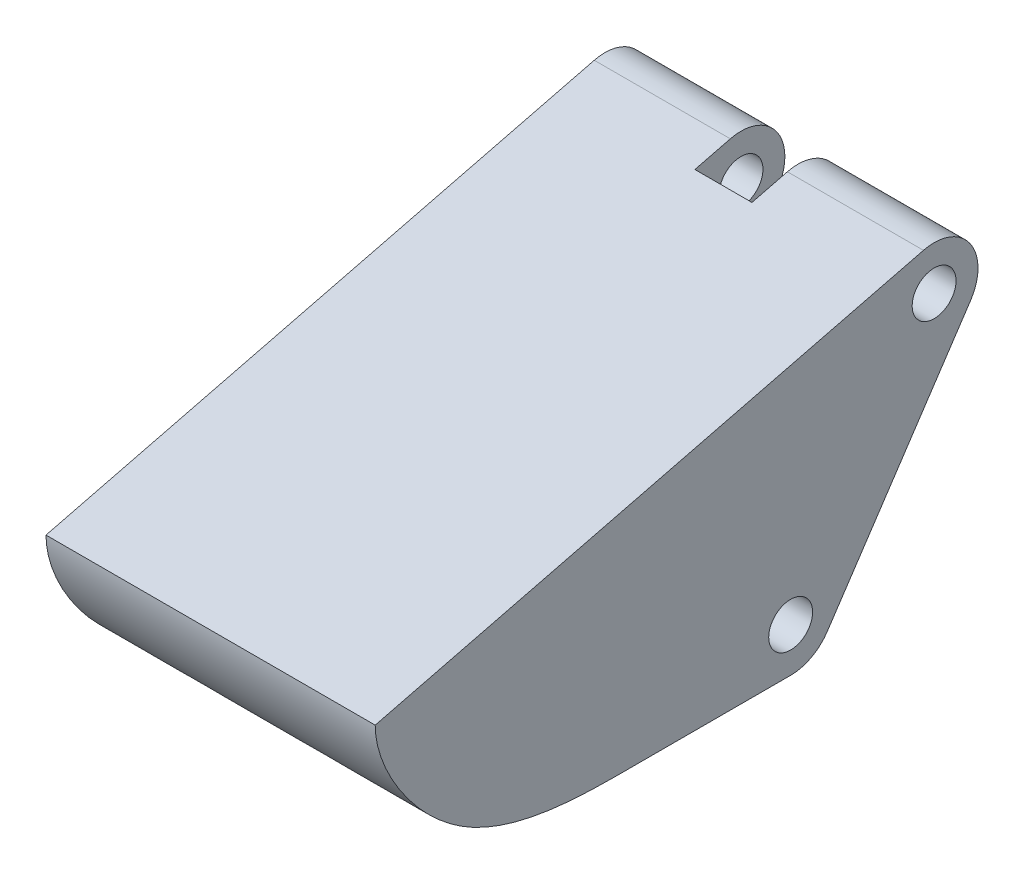
ISO-10303-21;
HEADER;
FILE_DESCRIPTION(('STEP AP214'),'2;1');
FILE_NAME('part.step','',(''),(''),'','','');
FILE_SCHEMA(('AUTOMOTIVE_DESIGN { 1 0 10303 214 1 1 1 1 }'));
ENDSEC;
DATA;
#1=APPLICATION_CONTEXT('core data for automotive mechanical design processes');
#2=APPLICATION_PROTOCOL_DEFINITION('international standard','automotive_design',2000,#1);
#3=PRODUCT_CONTEXT('',#1,'mechanical');
#4=PRODUCT('Part','Part','',(#3));
#5=PRODUCT_RELATED_PRODUCT_CATEGORY('part','',(#4));
#6=PRODUCT_DEFINITION_FORMATION('','',#4);
#7=PRODUCT_DEFINITION_CONTEXT('part definition',#1,'design');
#8=PRODUCT_DEFINITION('design','',#6,#7);
#9=PRODUCT_DEFINITION_SHAPE('','',#8);
#10=(LENGTH_UNIT() NAMED_UNIT(*) SI_UNIT(.MILLI.,.METRE.));
#11=(NAMED_UNIT(*) PLANE_ANGLE_UNIT() SI_UNIT($,.RADIAN.));
#12=(NAMED_UNIT(*) SI_UNIT($,.STERADIAN.) SOLID_ANGLE_UNIT());
#13=UNCERTAINTY_MEASURE_WITH_UNIT(LENGTH_MEASURE(1.E-05),#10,'distance_accuracy_value','');
#14=(GEOMETRIC_REPRESENTATION_CONTEXT(3) GLOBAL_UNCERTAINTY_ASSIGNED_CONTEXT((#13)) GLOBAL_UNIT_ASSIGNED_CONTEXT((#10,
#11,#12)) REPRESENTATION_CONTEXT('',''));
#15=CARTESIAN_POINT('',(0.,0.,0.));
#16=DIRECTION('',(0.,0.,1.));
#17=DIRECTION('',(1.,0.,0.));
#18=AXIS2_PLACEMENT_3D('',#15,#16,#17);
#19=CARTESIAN_POINT('',(-7.5,-5.5,11.070367516976));
#20=DIRECTION('',(1.,0.,0.));
#21=DIRECTION('',(0.,0.,1.));
#22=AXIS2_PLACEMENT_3D('',#19,#20,#21);
#23=CYLINDRICAL_SURFACE('',#22,2.);
#24=CARTESIAN_POINT('',(-5.,-5.5,11.070367516976));
#25=DIRECTION('',(1.,0.,0.));
#26=DIRECTION('',(0.,0.,-1.));
#27=AXIS2_PLACEMENT_3D('',#24,#25,#26);
#28=CIRCLE('',#27,2.);
#29=CARTESIAN_POINT('',(-5.,-6.60940039245046,9.4062669283003));
#30=VERTEX_POINT('',#29);
#31=CARTESIAN_POINT('',(-5.,-7.5,11.070367516976));
#32=VERTEX_POINT('',#31);
#33=EDGE_CURVE('E231',#30,#32,#28,.F.);
#34=ORIENTED_EDGE('',*,*,#33,.T.);
#35=DIRECTION('',(1.,0.,0.));
#36=VECTOR('',#35,1.);
#37=CARTESIAN_POINT('',(-7.5,-7.5,11.070367516976));
#38=LINE('',#37,#36);
#39=CARTESIAN_POINT('',(-7.5,-7.5,11.070367516976));
#40=VERTEX_POINT('',#39);
#41=EDGE_CURVE('E146',#40,#32,#38,.T.);
#42=ORIENTED_EDGE('',*,*,#41,.F.);
#43=CARTESIAN_POINT('',(-7.5,-5.5,11.070367516976));
#44=DIRECTION('',(1.,0.,0.));
#45=DIRECTION('',(0.,0.,-1.));
#46=AXIS2_PLACEMENT_3D('',#43,#44,#45);
#47=CIRCLE('',#46,2.);
#48=CARTESIAN_POINT('',(-7.5,-6.60940039245046,9.4062669283003));
#49=VERTEX_POINT('',#48);
#50=EDGE_CURVE('E125',#49,#40,#47,.F.);
#51=ORIENTED_EDGE('',*,*,#50,.F.);
#52=DIRECTION('',(1.,0.,0.));
#53=VECTOR('',#52,1.);
#54=CARTESIAN_POINT('',(-7.5,-6.60940039245046,9.4062669283003));
#55=LINE('',#54,#53);
#56=EDGE_CURVE('E133',#49,#30,#55,.T.);
#57=ORIENTED_EDGE('',*,*,#56,.T.);
#58=EDGE_LOOP('',(#34,#42,#51,#57));
#59=FACE_BOUND('',#58,.T.);
#60=ADVANCED_FACE('F49',(#59),#23,.T.);
#61=CARTESIAN_POINT('',(-7.5,-5.5,11.070367516976));
#62=DIRECTION('',(1.,0.,0.));
#63=DIRECTION('',(0.,0.,1.));
#64=AXIS2_PLACEMENT_3D('',#61,#62,#63);
#65=CYLINDRICAL_SURFACE('',#64,1.);
#66=CARTESIAN_POINT('',(-5.,-5.5,11.070367516976));
#67=DIRECTION('',(1.,0.,0.));
#68=DIRECTION('',(0.,0.,-1.));
#69=AXIS2_PLACEMENT_3D('',#66,#67,#68);
#70=CIRCLE('',#69,1.);
#71=CARTESIAN_POINT('',(-5.,-5.5,10.070367516976));
#72=VERTEX_POINT('',#71);
#73=EDGE_CURVE('E223',#72,#72,#70,.T.);
#74=ORIENTED_EDGE('',*,*,#73,.T.);
#75=EDGE_LOOP('',(#74));
#76=FACE_BOUND('',#75,.T.);
#77=CARTESIAN_POINT('',(-7.5,-5.5,11.070367516976));
#78=DIRECTION('',(1.,0.,0.));
#79=DIRECTION('',(0.,0.,-1.));
#80=AXIS2_PLACEMENT_3D('',#77,#78,#79);
#81=CIRCLE('',#80,1.);
#82=CARTESIAN_POINT('',(-7.5,-5.5,10.070367516976));
#83=VERTEX_POINT('',#82);
#84=EDGE_CURVE('E285',#83,#83,#81,.T.);
#85=ORIENTED_EDGE('',*,*,#84,.F.);
#86=EDGE_LOOP('',(#85));
#87=FACE_BOUND('',#86,.T.);
#88=ADVANCED_FACE('F313',(#76,#87),#65,.F.);
#89=CARTESIAN_POINT('',(-7.5,4.3050263695366,4.53368327061825));
#90=DIRECTION('',(1.,0.,0.));
#91=DIRECTION('',(0.,0.,1.));
#92=AXIS2_PLACEMENT_3D('',#89,#90,#91);
#93=CYLINDRICAL_SURFACE('',#92,1.);
#94=CARTESIAN_POINT('',(1.3,4.3050263695366,4.53368327061825));
#95=DIRECTION('',(-1.,0.,0.));
#96=DIRECTION('',(0.,0.,1.));
#97=AXIS2_PLACEMENT_3D('',#94,#95,#96);
#98=CIRCLE('',#97,1.);
#99=CARTESIAN_POINT('',(1.3,4.3050263695366,5.53368327061825));
#100=VERTEX_POINT('',#99);
#101=EDGE_CURVE('E275',#100,#100,#98,.T.);
#102=ORIENTED_EDGE('',*,*,#101,.T.);
#103=EDGE_LOOP('',(#102));
#104=FACE_BOUND('',#103,.T.);
#105=CARTESIAN_POINT('',(7.5,4.3050263695366,4.53368327061825));
#106=DIRECTION('',(1.,0.,0.));
#107=DIRECTION('',(0.,0.,-1.));
#108=AXIS2_PLACEMENT_3D('',#105,#106,#107);
#109=CIRCLE('',#108,1.);
#110=CARTESIAN_POINT('',(7.5,4.3050263695366,3.53368327061825));
#111=VERTEX_POINT('',#110);
#112=EDGE_CURVE('E157',#111,#111,#109,.T.);
#113=ORIENTED_EDGE('',*,*,#112,.T.);
#114=EDGE_LOOP('',(#113));
#115=FACE_BOUND('',#114,.T.);
#116=ADVANCED_FACE('F320',(#104,#115),#93,.F.);
#117=CARTESIAN_POINT('',(-7.5,4.3050263695366,4.53368327061825));
#118=DIRECTION('',(1.,0.,0.));
#119=DIRECTION('',(0.,0.,1.));
#120=AXIS2_PLACEMENT_3D('',#117,#118,#119);
#121=CYLINDRICAL_SURFACE('',#120,2.);
#122=CARTESIAN_POINT('',(1.3,4.3050263695366,4.53368327061825));
#123=DIRECTION('',(-1.,0.,0.));
#124=DIRECTION('',(0.,0.,1.));
#125=AXIS2_PLACEMENT_3D('',#122,#123,#124);
#126=CIRCLE('',#125,2.);
#127=CARTESIAN_POINT('',(1.3,6.24531136982727,5.01875452069092));
#128=VERTEX_POINT('',#127);
#129=CARTESIAN_POINT('',(1.3,3.19562597708615,2.86958268194257));
#130=VERTEX_POINT('',#129);
#131=EDGE_CURVE('E211',#128,#130,#126,.T.);
#132=ORIENTED_EDGE('',*,*,#131,.F.);
#133=DIRECTION('',(1.,0.,0.));
#134=VECTOR('',#133,1.);
#135=CARTESIAN_POINT('',(-7.5,6.24531136982727,5.01875452069092));
#136=LINE('',#135,#134);
#137=CARTESIAN_POINT('',(7.5,6.24531136982727,5.01875452069092));
#138=VERTEX_POINT('',#137);
#139=EDGE_CURVE('E156',#128,#138,#136,.T.);
#140=ORIENTED_EDGE('',*,*,#139,.T.);
#141=CARTESIAN_POINT('',(7.5,4.3050263695366,4.53368327061825));
#142=DIRECTION('',(1.,0.,0.));
#143=DIRECTION('',(0.,0.,-1.));
#144=AXIS2_PLACEMENT_3D('',#141,#142,#143);
#145=CIRCLE('',#144,2.);
#146=CARTESIAN_POINT('',(7.5,3.19562597708615,2.86958268194257));
#147=VERTEX_POINT('',#146);
#148=EDGE_CURVE('E187',#147,#138,#145,.T.);
#149=ORIENTED_EDGE('',*,*,#148,.F.);
#150=DIRECTION('',(1.,0.,0.));
#151=VECTOR('',#150,1.);
#152=CARTESIAN_POINT('',(-7.5,3.19562597708615,2.86958268194257));
#153=LINE('',#152,#151);
#154=EDGE_CURVE('E194',#130,#147,#153,.T.);
#155=ORIENTED_EDGE('',*,*,#154,.F.);
#156=EDGE_LOOP('',(#132,#140,#149,#155));
#157=FACE_BOUND('',#156,.T.);
#158=ADVANCED_FACE('F309',(#157),#121,.T.);
#159=CARTESIAN_POINT('',(-7.5,7.05882352941176,1.76470588235294));
#160=DIRECTION('',(0.,-0.970142500145332,-0.242535625036333));
#161=DIRECTION('',(0.,0.242535625036333,-0.970142500145332));
#162=AXIS2_PLACEMENT_3D('',#159,#160,#161);
#163=PLANE('',#162);
#164=DIRECTION('',(1.,0.,0.));
#165=VECTOR('',#164,1.);
#166=CARTESIAN_POINT('',(-7.5,5.84157918234543,6.63368327061825));
#167=LINE('',#166,#165);
#168=CARTESIAN_POINT('',(-1.3,5.84157918234543,6.63368327061825));
#169=VERTEX_POINT('',#168);
#170=CARTESIAN_POINT('',(1.3,5.84157918234543,6.63368327061825));
#171=VERTEX_POINT('',#170);
#172=EDGE_CURVE('E162',#169,#171,#167,.T.);
#173=ORIENTED_EDGE('',*,*,#172,.F.);
#174=DIRECTION('',(0.,-0.242535625036333,0.970142500145332));
#175=VECTOR('',#174,1.);
#176=CARTESIAN_POINT('',(-1.3,7.05882352941176,1.76470588235294));
#177=LINE('',#176,#175);
#178=CARTESIAN_POINT('',(-1.3,6.24531136982727,5.01875452069092));
#179=VERTEX_POINT('',#178);
#180=EDGE_CURVE('E259',#179,#169,#177,.T.);
#181=ORIENTED_EDGE('',*,*,#180,.F.);
#182=CARTESIAN_POINT('',(-7.5,6.24531136982727,5.01875452069092));
#183=VERTEX_POINT('',#182);
#184=EDGE_CURVE('E191',#183,#179,#136,.T.);
#185=ORIENTED_EDGE('',*,*,#184,.F.);
#186=DIRECTION('',(0.,-0.242535625036333,0.970142500145332));
#187=VECTOR('',#186,1.);
#188=CARTESIAN_POINT('',(-7.5,7.05882352941176,1.76470588235294));
#189=LINE('',#188,#187);
#190=CARTESIAN_POINT('',(-7.5,0.,30.));
#191=VERTEX_POINT('',#190);
#192=EDGE_CURVE('E289',#183,#191,#189,.T.);
#193=ORIENTED_EDGE('',*,*,#192,.T.);
#194=DIRECTION('',(1.,0.,0.));
#195=VECTOR('',#194,1.);
#196=CARTESIAN_POINT('',(-7.5,0.,30.));
#197=LINE('',#196,#195);
#198=CARTESIAN_POINT('',(7.5,0.,30.));
#199=VERTEX_POINT('',#198);
#200=EDGE_CURVE('E204',#191,#199,#197,.T.);
#201=ORIENTED_EDGE('',*,*,#200,.T.);
#202=DIRECTION('',(0.,-0.242535625036333,0.970142500145332));
#203=VECTOR('',#202,1.);
#204=CARTESIAN_POINT('',(7.5,7.05882352941176,1.76470588235294));
#205=LINE('',#204,#203);
#206=EDGE_CURVE('E102',#138,#199,#205,.T.);
#207=ORIENTED_EDGE('',*,*,#206,.F.);
#208=ORIENTED_EDGE('',*,*,#139,.F.);
#209=DIRECTION('',(0.,0.242535625036333,-0.970142500145332));
#210=VECTOR('',#209,1.);
#211=CARTESIAN_POINT('',(1.3,7.05882352941176,1.76470588235294));
#212=LINE('',#211,#210);
#213=EDGE_CURVE('E267',#171,#128,#212,.T.);
#214=ORIENTED_EDGE('',*,*,#213,.F.);
#215=EDGE_LOOP('',(#173,#181,#185,#193,#201,#207,#208,#214));
#216=FACE_BOUND('',#215,.T.);
#217=ADVANCED_FACE('F305',(#216),#163,.F.);
#218=CARTESIAN_POINT('',(-7.5,0.,30.));
#219=CARTESIAN_POINT('',(-7.5,-1.86201061413692,30.));
#220=CARTESIAN_POINT('',(-7.5,-7.67088107731904,26.2969055526664));
#221=CARTESIAN_POINT('',(-7.5,-7.5,20.233591890825));
#222=CARTESIAN_POINT('',(-7.5,-7.5,18.));
#223=B_SPLINE_CURVE_WITH_KNOTS('',3,(#218,#219,#220,#221,#222),.UNSPECIFIED.,.F.,.F.,(4,1,4),
(0.,0.469762972864334,1.),.UNSPECIFIED.);
#224=DIRECTION('',(1.,0.,0.));
#225=VECTOR('',#224,1.);
#226=SURFACE_OF_LINEAR_EXTRUSION('',#223,#225);
#227=CARTESIAN_POINT('',(7.5,0.,30.));
#228=CARTESIAN_POINT('',(7.5,-1.86201061413692,30.));
#229=CARTESIAN_POINT('',(7.5,-7.67088107731904,26.2969055526664));
#230=CARTESIAN_POINT('',(7.5,-7.5,20.233591890825));
#231=CARTESIAN_POINT('',(7.5,-7.5,18.));
#232=B_SPLINE_CURVE_WITH_KNOTS('',3,(#227,#228,#229,#230,#231),.UNSPECIFIED.,.F.,.F.,(4,1,4),
(0.,0.469762972864334,1.),.UNSPECIFIED.);
#233=CARTESIAN_POINT('',(7.5,-7.5,18.));
#234=VERTEX_POINT('',#233);
#235=EDGE_CURVE('E168',#199,#234,#232,.T.);
#236=ORIENTED_EDGE('',*,*,#235,.F.);
#237=ORIENTED_EDGE('',*,*,#200,.F.);
#238=CARTESIAN_POINT('',(-7.5,-7.5,18.));
#239=VERTEX_POINT('',#238);
#240=EDGE_CURVE('E110',#191,#239,#223,.T.);
#241=ORIENTED_EDGE('',*,*,#240,.T.);
#242=DIRECTION('',(1.,0.,0.));
#243=VECTOR('',#242,1.);
#244=CARTESIAN_POINT('',(-7.5,-7.5,18.));
#245=LINE('',#244,#243);
#246=EDGE_CURVE('E200',#239,#234,#245,.T.);
#247=ORIENTED_EDGE('',*,*,#246,.T.);
#248=EDGE_LOOP('',(#236,#237,#241,#247));
#249=FACE_BOUND('',#248,.T.);
#250=ADVANCED_FACE('F300',(#249),#226,.T.);
#251=CARTESIAN_POINT('',(-7.5,-7.5,0.));
#252=DIRECTION('',(0.,1.,0.));
#253=DIRECTION('',(0.,0.,1.));
#254=AXIS2_PLACEMENT_3D('',#251,#252,#253);
#255=PLANE('',#254);
#256=CARTESIAN_POINT('',(0.,-7.5,10.7537427266206));
#257=DIRECTION('',(0.,1.,0.));
#258=DIRECTION('',(0.,0.,1.));
#259=AXIS2_PLACEMENT_3D('',#256,#257,#258);
#260=CIRCLE('',#259,6.);
#261=CARTESIAN_POINT('',(-5.,-7.5,14.070367516976));
#262=VERTEX_POINT('',#261);
#263=CARTESIAN_POINT('',(5.,-7.5,14.070367516976));
#264=VERTEX_POINT('',#263);
#265=EDGE_CURVE('E340',#262,#264,#260,.T.);
#266=ORIENTED_EDGE('',*,*,#265,.T.);
#267=DIRECTION('',(0.,0.,-1.));
#268=VECTOR('',#267,1.);
#269=CARTESIAN_POINT('',(5.,-7.5,7.07036751697599));
#270=LINE('',#269,#268);
#271=CARTESIAN_POINT('',(5.,-7.5,11.070367516976));
#272=VERTEX_POINT('',#271);
#273=EDGE_CURVE('E344',#264,#272,#270,.T.);
#274=ORIENTED_EDGE('',*,*,#273,.T.);
#275=CARTESIAN_POINT('',(7.5,-7.5,11.070367516976));
#276=VERTEX_POINT('',#275);
#277=EDGE_CURVE('E142',#272,#276,#38,.T.);
#278=ORIENTED_EDGE('',*,*,#277,.T.);
#279=DIRECTION('',(0.,0.,-1.));
#280=VECTOR('',#279,1.);
#281=CARTESIAN_POINT('',(7.5,-7.5,0.));
#282=LINE('',#281,#280);
#283=EDGE_CURVE('E174',#234,#276,#282,.T.);
#284=ORIENTED_EDGE('',*,*,#283,.F.);
#285=ORIENTED_EDGE('',*,*,#246,.F.);
#286=DIRECTION('',(0.,0.,-1.));
#287=VECTOR('',#286,1.);
#288=CARTESIAN_POINT('',(-7.5,-7.5,0.));
#289=LINE('',#288,#287);
#290=EDGE_CURVE('E148',#239,#40,#289,.T.);
#291=ORIENTED_EDGE('',*,*,#290,.T.);
#292=ORIENTED_EDGE('',*,*,#41,.T.);
#293=DIRECTION('',(0.,0.,1.));
#294=VECTOR('',#293,1.);
#295=CARTESIAN_POINT('',(-5.,-7.5,7.07036751697599));
#296=LINE('',#295,#294);
#297=EDGE_CURVE('E347',#32,#262,#296,.T.);
#298=ORIENTED_EDGE('',*,*,#297,.T.);
#299=EDGE_LOOP('',(#266,#274,#278,#284,#285,#291,#292,#298));
#300=FACE_BOUND('',#299,.T.);
#301=ADVANCED_FACE('F304',(#300),#255,.F.);
#302=CARTESIAN_POINT('',(5.,-5.5,11.070367516976));
#303=DIRECTION('',(-1.,0.,0.));
#304=DIRECTION('',(0.,0.,1.));
#305=AXIS2_PLACEMENT_3D('',#302,#303,#304);
#306=CIRCLE('',#305,2.);
#307=CARTESIAN_POINT('',(5.,-6.60940039245046,9.4062669283003));
#308=VERTEX_POINT('',#307);
#309=EDGE_CURVE('E226',#272,#308,#306,.F.);
#310=ORIENTED_EDGE('',*,*,#309,.T.);
#311=CARTESIAN_POINT('',(7.5,-6.60940039245046,9.4062669283003));
#312=VERTEX_POINT('',#311);
#313=EDGE_CURVE('E143',#308,#312,#55,.T.);
#314=ORIENTED_EDGE('',*,*,#313,.T.);
#315=CARTESIAN_POINT('',(7.5,-5.5,11.070367516976));
#316=DIRECTION('',(1.,0.,0.));
#317=DIRECTION('',(0.,0.,-1.));
#318=AXIS2_PLACEMENT_3D('',#315,#316,#317);
#319=CIRCLE('',#318,2.);
#320=EDGE_CURVE('E181',#312,#276,#319,.F.);
#321=ORIENTED_EDGE('',*,*,#320,.T.);
#322=ORIENTED_EDGE('',*,*,#277,.F.);
#323=EDGE_LOOP('',(#310,#314,#321,#322));
#324=FACE_BOUND('',#323,.T.);
#325=ADVANCED_FACE('F321',(#324),#23,.T.);
#326=CARTESIAN_POINT('',(-7.5,2.30769230769231,3.46153846153846));
#327=DIRECTION('',(0.,-0.554700196225229,-0.832050294337844));
#328=DIRECTION('',(0.,0.832050294337844,-0.554700196225229));
#329=AXIS2_PLACEMENT_3D('',#326,#327,#328);
#330=PLANE('',#329);
#331=DIRECTION('',(0.,-0.832050294337844,0.554700196225229));
#332=VECTOR('',#331,1.);
#333=CARTESIAN_POINT('',(-5.,2.30769230769231,3.46153846153846));
#334=LINE('',#333,#332);
#335=CARTESIAN_POINT('',(-5.,-3.5,7.33333333333333));
#336=VERTEX_POINT('',#335);
#337=EDGE_CURVE('E137',#336,#30,#334,.T.);
#338=ORIENTED_EDGE('',*,*,#337,.T.);
#339=ORIENTED_EDGE('',*,*,#56,.F.);
#340=DIRECTION('',(0.,-0.832050294337844,0.554700196225229));
#341=VECTOR('',#340,1.);
#342=CARTESIAN_POINT('',(-7.5,2.30769230769231,3.46153846153846));
#343=LINE('',#342,#341);
#344=CARTESIAN_POINT('',(-7.5,3.19562597708615,2.86958268194257));
#345=VERTEX_POINT('',#344);
#346=EDGE_CURVE('E121',#345,#49,#343,.T.);
#347=ORIENTED_EDGE('',*,*,#346,.F.);
#348=CARTESIAN_POINT('',(-1.3,3.19562597708615,2.86958268194257));
#349=VERTEX_POINT('',#348);
#350=EDGE_CURVE('E195',#345,#349,#153,.T.);
#351=ORIENTED_EDGE('',*,*,#350,.T.);
#352=DIRECTION('',(0.,-0.832050294337844,0.554700196225229));
#353=VECTOR('',#352,1.);
#354=CARTESIAN_POINT('',(-1.3,2.30769230769231,3.46153846153846));
#355=LINE('',#354,#353);
#356=CARTESIAN_POINT('',(-1.3,-2.45052490592739,6.63368327061825));
#357=VERTEX_POINT('',#356);
#358=EDGE_CURVE('E252',#349,#357,#355,.T.);
#359=ORIENTED_EDGE('',*,*,#358,.T.);
#360=DIRECTION('',(1.,0.,0.));
#361=VECTOR('',#360,1.);
#362=CARTESIAN_POINT('',(-7.5,-2.45052490592739,6.63368327061825));
#363=LINE('',#362,#361);
#364=CARTESIAN_POINT('',(1.3,-2.45052490592739,6.63368327061825));
#365=VERTEX_POINT('',#364);
#366=EDGE_CURVE('E58',#357,#365,#363,.T.);
#367=ORIENTED_EDGE('',*,*,#366,.T.);
#368=DIRECTION('',(0.,0.832050294337844,-0.554700196225229));
#369=VECTOR('',#368,1.);
#370=CARTESIAN_POINT('',(1.3,2.30769230769231,3.46153846153846));
#371=LINE('',#370,#369);
#372=EDGE_CURVE('E271',#365,#130,#371,.T.);
#373=ORIENTED_EDGE('',*,*,#372,.T.);
#374=ORIENTED_EDGE('',*,*,#154,.T.);
#375=DIRECTION('',(0.,-0.832050294337844,0.554700196225229));
#376=VECTOR('',#375,1.);
#377=CARTESIAN_POINT('',(7.5,2.30769230769231,3.46153846153846));
#378=LINE('',#377,#376);
#379=EDGE_CURVE('E184',#147,#312,#378,.T.);
#380=ORIENTED_EDGE('',*,*,#379,.T.);
#381=ORIENTED_EDGE('',*,*,#313,.F.);
#382=DIRECTION('',(0.,0.832050294337844,-0.554700196225229));
#383=VECTOR('',#382,1.);
#384=CARTESIAN_POINT('',(5.,2.30769230769231,3.46153846153846));
#385=LINE('',#384,#383);
#386=CARTESIAN_POINT('',(5.,-3.5,7.33333333333333));
#387=VERTEX_POINT('',#386);
#388=EDGE_CURVE('E221',#308,#387,#385,.T.);
#389=ORIENTED_EDGE('',*,*,#388,.T.);
#390=DIRECTION('',(-1.,0.,0.));
#391=VECTOR('',#390,1.);
#392=CARTESIAN_POINT('',(-7.5,-3.5,7.33333333333333));
#393=LINE('',#392,#391);
#394=EDGE_CURVE('E11',#387,#336,#393,.T.);
#395=ORIENTED_EDGE('',*,*,#394,.T.);
#396=EDGE_LOOP('',(#338,#339,#347,#351,#359,#367,#373,#374,#380,#381,#389,#395));
#397=FACE_BOUND('',#396,.T.);
#398=ADVANCED_FACE('F134',(#397),#330,.T.);
#399=CARTESIAN_POINT('',(5.,-5.5,11.070367516976));
#400=DIRECTION('',(-1.,0.,0.));
#401=DIRECTION('',(0.,0.,1.));
#402=AXIS2_PLACEMENT_3D('',#399,#400,#401);
#403=CIRCLE('',#402,1.);
#404=CARTESIAN_POINT('',(5.,-5.5,12.070367516976));
#405=VERTEX_POINT('',#404);
#406=EDGE_CURVE('E218',#405,#405,#403,.T.);
#407=ORIENTED_EDGE('',*,*,#406,.T.);
#408=EDGE_LOOP('',(#407));
#409=FACE_BOUND('',#408,.T.);
#410=CARTESIAN_POINT('',(7.5,-5.5,11.070367516976));
#411=DIRECTION('',(1.,0.,0.));
#412=DIRECTION('',(0.,0.,-1.));
#413=AXIS2_PLACEMENT_3D('',#410,#411,#412);
#414=CIRCLE('',#413,1.);
#415=CARTESIAN_POINT('',(7.5,-5.5,10.070367516976));
#416=VERTEX_POINT('',#415);
#417=EDGE_CURVE('E161',#416,#416,#414,.T.);
#418=ORIENTED_EDGE('',*,*,#417,.T.);
#419=EDGE_LOOP('',(#418));
#420=FACE_BOUND('',#419,.T.);
#421=ADVANCED_FACE('F310',(#409,#420),#65,.F.);
#422=CARTESIAN_POINT('',(-1.3,4.3050263695366,4.53368327061825));
#423=DIRECTION('',(1.,0.,0.));
#424=DIRECTION('',(0.,0.,-1.));
#425=AXIS2_PLACEMENT_3D('',#422,#423,#424);
#426=CIRCLE('',#425,1.);
#427=CARTESIAN_POINT('',(-1.3,4.3050263695366,3.53368327061825));
#428=VERTEX_POINT('',#427);
#429=EDGE_CURVE('E263',#428,#428,#426,.T.);
#430=ORIENTED_EDGE('',*,*,#429,.T.);
#431=EDGE_LOOP('',(#430));
#432=FACE_BOUND('',#431,.T.);
#433=CARTESIAN_POINT('',(-7.5,4.3050263695366,4.53368327061825));
#434=DIRECTION('',(1.,0.,0.));
#435=DIRECTION('',(0.,0.,-1.));
#436=AXIS2_PLACEMENT_3D('',#433,#434,#435);
#437=CIRCLE('',#436,1.);
#438=CARTESIAN_POINT('',(-7.5,4.3050263695366,3.53368327061825));
#439=VERTEX_POINT('',#438);
#440=EDGE_CURVE('E190',#439,#439,#437,.T.);
#441=ORIENTED_EDGE('',*,*,#440,.F.);
#442=EDGE_LOOP('',(#441));
#443=FACE_BOUND('',#442,.T.);
#444=ADVANCED_FACE('F51',(#432,#443),#93,.F.);
#445=ORIENTED_EDGE('',*,*,#350,.F.);
#446=CARTESIAN_POINT('',(-7.5,4.3050263695366,4.53368327061825));
#447=DIRECTION('',(1.,0.,0.));
#448=DIRECTION('',(0.,0.,-1.));
#449=AXIS2_PLACEMENT_3D('',#446,#447,#448);
#450=CIRCLE('',#449,2.);
#451=EDGE_CURVE('E74',#345,#183,#450,.T.);
#452=ORIENTED_EDGE('',*,*,#451,.T.);
#453=ORIENTED_EDGE('',*,*,#184,.T.);
#454=CARTESIAN_POINT('',(-1.3,4.3050263695366,4.53368327061825));
#455=DIRECTION('',(1.,0.,0.));
#456=DIRECTION('',(0.,0.,-1.));
#457=AXIS2_PLACEMENT_3D('',#454,#455,#456);
#458=CIRCLE('',#457,2.);
#459=EDGE_CURVE('E207',#349,#179,#458,.T.);
#460=ORIENTED_EDGE('',*,*,#459,.F.);
#461=EDGE_LOOP('',(#445,#452,#453,#460));
#462=FACE_BOUND('',#461,.T.);
#463=ADVANCED_FACE('F318',(#462),#121,.T.);
#464=CARTESIAN_POINT('',(-7.5,0.,0.));
#465=DIRECTION('',(-1.,0.,0.));
#466=DIRECTION('',(0.,0.,-1.));
#467=AXIS2_PLACEMENT_3D('',#464,#465,#466);
#468=PLANE('',#467);
#469=ORIENTED_EDGE('',*,*,#440,.T.);
#470=EDGE_LOOP('',(#469));
#471=FACE_BOUND('',#470,.T.);
#472=ORIENTED_EDGE('',*,*,#84,.T.);
#473=EDGE_LOOP('',(#472));
#474=FACE_BOUND('',#473,.T.);
#475=ORIENTED_EDGE('',*,*,#192,.F.);
#476=ORIENTED_EDGE('',*,*,#451,.F.);
#477=ORIENTED_EDGE('',*,*,#346,.T.);
#478=ORIENTED_EDGE('',*,*,#50,.T.);
#479=ORIENTED_EDGE('',*,*,#290,.F.);
#480=ORIENTED_EDGE('',*,*,#240,.F.);
#481=EDGE_LOOP('',(#475,#476,#477,#478,#479,#480));
#482=FACE_BOUND('',#481,.T.);
#483=ADVANCED_FACE('F123',(#471,#474,#482),#468,.T.);
#484=CARTESIAN_POINT('',(7.5,0.,0.));
#485=DIRECTION('',(-1.,0.,0.));
#486=DIRECTION('',(0.,0.,-1.));
#487=AXIS2_PLACEMENT_3D('',#484,#485,#486);
#488=PLANE('',#487);
#489=ORIENTED_EDGE('',*,*,#112,.F.);
#490=EDGE_LOOP('',(#489));
#491=FACE_BOUND('',#490,.T.);
#492=ORIENTED_EDGE('',*,*,#417,.F.);
#493=EDGE_LOOP('',(#492));
#494=FACE_BOUND('',#493,.T.);
#495=ORIENTED_EDGE('',*,*,#206,.T.);
#496=ORIENTED_EDGE('',*,*,#235,.T.);
#497=ORIENTED_EDGE('',*,*,#283,.T.);
#498=ORIENTED_EDGE('',*,*,#320,.F.);
#499=ORIENTED_EDGE('',*,*,#379,.F.);
#500=ORIENTED_EDGE('',*,*,#148,.T.);
#501=EDGE_LOOP('',(#495,#496,#497,#498,#499,#500));
#502=FACE_BOUND('',#501,.T.);
#503=ADVANCED_FACE('F430',(#491,#494,#502),#488,.F.);
#504=CARTESIAN_POINT('',(-1.3,-8.69497363046339,6.63368327061825));
#505=DIRECTION('',(0.,0.,1.));
#506=DIRECTION('',(-1.,0.,0.));
#507=AXIS2_PLACEMENT_3D('',#504,#505,#506);
#508=PLANE('',#507);
#509=DIRECTION('',(0.,1.,0.));
#510=VECTOR('',#509,1.);
#511=CARTESIAN_POINT('',(-1.3,-8.69497363046339,6.63368327061825));
#512=LINE('',#511,#510);
#513=EDGE_CURVE('E248',#357,#169,#512,.T.);
#514=ORIENTED_EDGE('',*,*,#513,.T.);
#515=ORIENTED_EDGE('',*,*,#172,.T.);
#516=DIRECTION('',(0.,1.,0.));
#517=VECTOR('',#516,1.);
#518=CARTESIAN_POINT('',(1.3,-8.69497363046339,6.63368327061825));
#519=LINE('',#518,#517);
#520=EDGE_CURVE('E247',#365,#171,#519,.T.);
#521=ORIENTED_EDGE('',*,*,#520,.F.);
#522=ORIENTED_EDGE('',*,*,#366,.F.);
#523=EDGE_LOOP('',(#514,#515,#521,#522));
#524=FACE_BOUND('',#523,.T.);
#525=ADVANCED_FACE('F421',(#524),#508,.F.);
#526=CARTESIAN_POINT('',(1.3,-8.69497363046339,6.63368327061825));
#527=DIRECTION('',(1.,0.,0.));
#528=DIRECTION('',(0.,0.,1.));
#529=AXIS2_PLACEMENT_3D('',#526,#527,#528);
#530=PLANE('',#529);
#531=ORIENTED_EDGE('',*,*,#101,.F.);
#532=EDGE_LOOP('',(#531));
#533=FACE_BOUND('',#532,.T.);
#534=ORIENTED_EDGE('',*,*,#372,.F.);
#535=ORIENTED_EDGE('',*,*,#520,.T.);
#536=ORIENTED_EDGE('',*,*,#213,.T.);
#537=ORIENTED_EDGE('',*,*,#131,.T.);
#538=EDGE_LOOP('',(#534,#535,#536,#537));
#539=FACE_BOUND('',#538,.T.);
#540=ADVANCED_FACE('F418',(#533,#539),#530,.F.);
#541=CARTESIAN_POINT('',(-1.3,-8.69497363046339,6.63368327061825));
#542=DIRECTION('',(-1.,0.,0.));
#543=DIRECTION('',(0.,0.,-1.));
#544=AXIS2_PLACEMENT_3D('',#541,#542,#543);
#545=PLANE('',#544);
#546=ORIENTED_EDGE('',*,*,#429,.F.);
#547=EDGE_LOOP('',(#546));
#548=FACE_BOUND('',#547,.T.);
#549=ORIENTED_EDGE('',*,*,#459,.T.);
#550=ORIENTED_EDGE('',*,*,#180,.T.);
#551=ORIENTED_EDGE('',*,*,#513,.F.);
#552=ORIENTED_EDGE('',*,*,#358,.F.);
#553=EDGE_LOOP('',(#549,#550,#551,#552));
#554=FACE_BOUND('',#553,.T.);
#555=ADVANCED_FACE('F420',(#548,#554),#545,.F.);
#556=CARTESIAN_POINT('',(0.,-3.5,10.7537427266206));
#557=DIRECTION('',(0.,-1.,0.));
#558=DIRECTION('',(0.,0.,-1.));
#559=AXIS2_PLACEMENT_3D('',#556,#557,#558);
#560=CYLINDRICAL_SURFACE('',#559,6.);
#561=ORIENTED_EDGE('',*,*,#265,.F.);
#562=DIRECTION('',(0.,-1.,0.));
#563=VECTOR('',#562,1.);
#564=CARTESIAN_POINT('',(-5.,-3.5,14.070367516976));
#565=LINE('',#564,#563);
#566=CARTESIAN_POINT('',(-5.,-3.5,14.070367516976));
#567=VERTEX_POINT('',#566);
#568=EDGE_CURVE('E222',#567,#262,#565,.T.);
#569=ORIENTED_EDGE('',*,*,#568,.F.);
#570=CARTESIAN_POINT('',(0.,-3.5,10.7537427266206));
#571=DIRECTION('',(0.,1.,0.));
#572=DIRECTION('',(0.,0.,1.));
#573=AXIS2_PLACEMENT_3D('',#570,#571,#572);
#574=CIRCLE('',#573,6.);
#575=CARTESIAN_POINT('',(5.,-3.5,14.070367516976));
#576=VERTEX_POINT('',#575);
#577=EDGE_CURVE('E362',#567,#576,#574,.T.);
#578=ORIENTED_EDGE('',*,*,#577,.T.);
#579=DIRECTION('',(0.,-1.,0.));
#580=VECTOR('',#579,1.);
#581=CARTESIAN_POINT('',(5.,-3.5,14.070367516976));
#582=LINE('',#581,#580);
#583=EDGE_CURVE('E365',#576,#264,#582,.T.);
#584=ORIENTED_EDGE('',*,*,#583,.T.);
#585=EDGE_LOOP('',(#561,#569,#578,#584));
#586=FACE_BOUND('',#585,.T.);
#587=ADVANCED_FACE('F378',(#586),#560,.F.);
#588=CARTESIAN_POINT('',(-5.,-3.5,7.07036751697599));
#589=DIRECTION('',(-1.,0.,0.));
#590=DIRECTION('',(0.,0.,-1.));
#591=AXIS2_PLACEMENT_3D('',#588,#589,#590);
#592=PLANE('',#591);
#593=ORIENTED_EDGE('',*,*,#33,.F.);
#594=ORIENTED_EDGE('',*,*,#337,.F.);
#595=DIRECTION('',(0.,0.,1.));
#596=VECTOR('',#595,1.);
#597=CARTESIAN_POINT('',(-5.,-3.5,7.07036751697599));
#598=LINE('',#597,#596);
#599=EDGE_CURVE('E357',#336,#567,#598,.T.);
#600=ORIENTED_EDGE('',*,*,#599,.T.);
#601=ORIENTED_EDGE('',*,*,#568,.T.);
#602=ORIENTED_EDGE('',*,*,#297,.F.);
#603=EDGE_LOOP('',(#593,#594,#600,#601,#602));
#604=FACE_BOUND('',#603,.T.);
#605=ORIENTED_EDGE('',*,*,#73,.F.);
#606=EDGE_LOOP('',(#605));
#607=FACE_BOUND('',#606,.T.);
#608=ADVANCED_FACE('F470',(#604,#607),#592,.F.);
#609=CARTESIAN_POINT('',(5.,-3.5,7.07036751697599));
#610=DIRECTION('',(1.,0.,0.));
#611=DIRECTION('',(0.,0.,1.));
#612=AXIS2_PLACEMENT_3D('',#609,#610,#611);
#613=PLANE('',#612);
#614=ORIENTED_EDGE('',*,*,#309,.F.);
#615=ORIENTED_EDGE('',*,*,#273,.F.);
#616=ORIENTED_EDGE('',*,*,#583,.F.);
#617=DIRECTION('',(0.,0.,-1.));
#618=VECTOR('',#617,1.);
#619=CARTESIAN_POINT('',(5.,-3.5,7.07036751697599));
#620=LINE('',#619,#618);
#621=EDGE_CURVE('E65',#576,#387,#620,.T.);
#622=ORIENTED_EDGE('',*,*,#621,.T.);
#623=ORIENTED_EDGE('',*,*,#388,.F.);
#624=EDGE_LOOP('',(#614,#615,#616,#622,#623));
#625=FACE_BOUND('',#624,.T.);
#626=ORIENTED_EDGE('',*,*,#406,.F.);
#627=EDGE_LOOP('',(#626));
#628=FACE_BOUND('',#627,.T.);
#629=ADVANCED_FACE('F467',(#625,#628),#613,.F.);
#630=CARTESIAN_POINT('',(0.,-3.5,10.7537427266206));
#631=DIRECTION('',(0.,1.,0.));
#632=DIRECTION('',(0.,0.,1.));
#633=AXIS2_PLACEMENT_3D('',#630,#631,#632);
#634=PLANE('',#633);
#635=ORIENTED_EDGE('',*,*,#394,.F.);
#636=ORIENTED_EDGE('',*,*,#621,.F.);
#637=ORIENTED_EDGE('',*,*,#577,.F.);
#638=ORIENTED_EDGE('',*,*,#599,.F.);
#639=EDGE_LOOP('',(#635,#636,#637,#638));
#640=FACE_BOUND('',#639,.T.);
#641=ADVANCED_FACE('F381',(#640),#634,.F.);
#642=CLOSED_SHELL('',(#60,#88,#116,#158,#217,#250,#301,#325,#398,#421,#444,#463,#483,#503,#525,
#540,#555,#587,#608,#629,#641));
#643=MANIFOLD_SOLID_BREP('B2',#642);
#644=ADVANCED_BREP_SHAPE_REPRESENTATION('',(#18,#643),#14);
#645=SHAPE_DEFINITION_REPRESENTATION(#9,#644);
ENDSEC;
END-ISO-10303-21;
